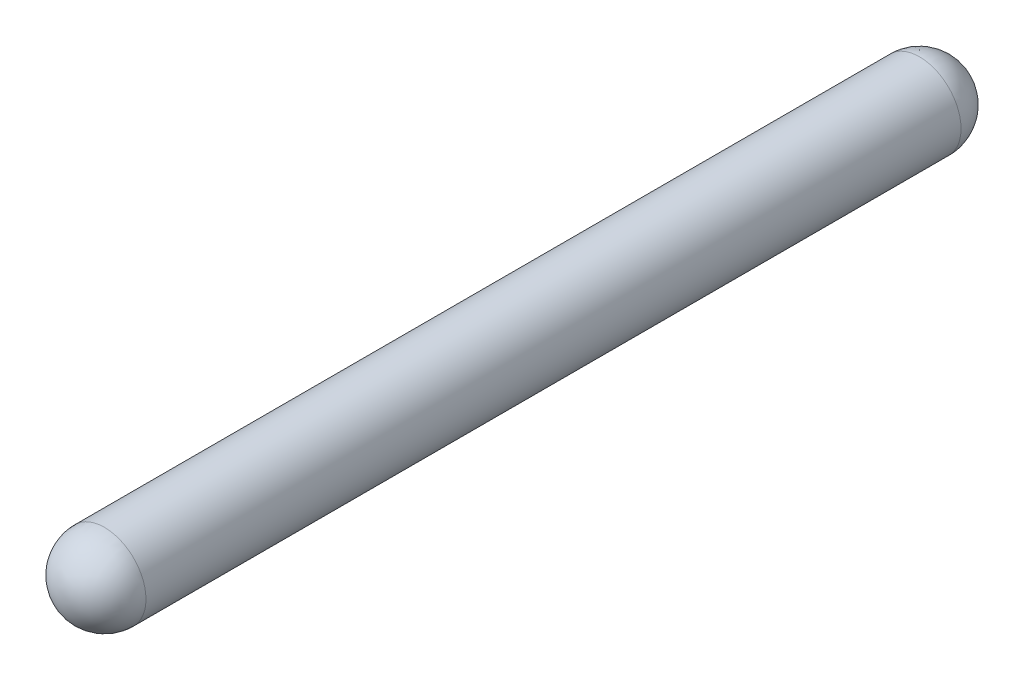
ISO-10303-21;
HEADER;
FILE_DESCRIPTION(('STEP AP214'),'2;1');
FILE_NAME('part.step','',(''),(''),'','','');
FILE_SCHEMA(('AUTOMOTIVE_DESIGN { 1 0 10303 214 1 1 1 1 }'));
ENDSEC;
DATA;
#1=APPLICATION_CONTEXT('core data for automotive mechanical design processes');
#2=APPLICATION_PROTOCOL_DEFINITION('international standard','automotive_design',2000,#1);
#3=PRODUCT_CONTEXT('',#1,'mechanical');
#4=PRODUCT('Part','Part','',(#3));
#5=PRODUCT_RELATED_PRODUCT_CATEGORY('part','',(#4));
#6=PRODUCT_DEFINITION_FORMATION('','',#4);
#7=PRODUCT_DEFINITION_CONTEXT('part definition',#1,'design');
#8=PRODUCT_DEFINITION('design','',#6,#7);
#9=PRODUCT_DEFINITION_SHAPE('','',#8);
#10=(LENGTH_UNIT() NAMED_UNIT(*) SI_UNIT(.MILLI.,.METRE.));
#11=(NAMED_UNIT(*) PLANE_ANGLE_UNIT() SI_UNIT($,.RADIAN.));
#12=(NAMED_UNIT(*) SI_UNIT($,.STERADIAN.) SOLID_ANGLE_UNIT());
#13=UNCERTAINTY_MEASURE_WITH_UNIT(LENGTH_MEASURE(1.E-05),#10,'distance_accuracy_value','');
#14=(GEOMETRIC_REPRESENTATION_CONTEXT(3) GLOBAL_UNCERTAINTY_ASSIGNED_CONTEXT((#13)) GLOBAL_UNIT_ASSIGNED_CONTEXT((#10,
#11,#12)) REPRESENTATION_CONTEXT('',''));
#15=CARTESIAN_POINT('',(0.,0.,0.));
#16=DIRECTION('',(0.,0.,1.));
#17=DIRECTION('',(1.,0.,0.));
#18=AXIS2_PLACEMENT_3D('',#15,#16,#17);
#19=CARTESIAN_POINT('',(-0.936,-8.69,-3.));
#20=DIRECTION('',(1.,0.,0.));
#21=DIRECTION('',(0.,-1.,0.));
#22=AXIS2_PLACEMENT_3D('',#19,#20,#21);
#23=SPHERICAL_SURFACE('',#22,0.331);
#24=CARTESIAN_POINT('',(-0.936,-8.69,-3.));
#25=DIRECTION('',(0.,0.,1.));
#26=DIRECTION('',(1.,0.,0.));
#27=AXIS2_PLACEMENT_3D('',#24,#25,#26);
#28=CIRCLE('',#27,0.331);
#29=CARTESIAN_POINT('',(-0.605,-8.69,-3.));
#30=VERTEX_POINT('',#29);
#31=CARTESIAN_POINT('',(-1.267,-8.69,-3.));
#32=VERTEX_POINT('',#31);
#33=EDGE_CURVE('E42',#30,#32,#28,.T.);
#34=ORIENTED_EDGE('',*,*,#33,.F.);
#35=CARTESIAN_POINT('',(-0.936,-8.69,-3.));
#36=DIRECTION('',(0.,0.,1.));
#37=DIRECTION('',(1.,0.,0.));
#38=AXIS2_PLACEMENT_3D('',#35,#36,#37);
#39=CIRCLE('',#38,0.331);
#40=EDGE_CURVE('E26',#32,#30,#39,.T.);
#41=ORIENTED_EDGE('',*,*,#40,.F.);
#42=EDGE_LOOP('',(#34,#41));
#43=FACE_BOUND('',#42,.T.);
#44=ADVANCED_FACE('F17',(#43),#23,.T.);
#45=CARTESIAN_POINT('',(-0.936,-8.69,3.5));
#46=DIRECTION('',(1.,0.,0.));
#47=DIRECTION('',(0.,1.,0.));
#48=AXIS2_PLACEMENT_3D('',#45,#46,#47);
#49=SPHERICAL_SURFACE('',#48,0.331);
#50=CARTESIAN_POINT('',(-0.936,-8.69,3.5));
#51=DIRECTION('',(0.,0.,1.));
#52=DIRECTION('',(1.,0.,0.));
#53=AXIS2_PLACEMENT_3D('',#50,#51,#52);
#54=CIRCLE('',#53,0.331);
#55=CARTESIAN_POINT('',(-0.605,-8.69,3.5));
#56=VERTEX_POINT('',#55);
#57=CARTESIAN_POINT('',(-1.267,-8.69,3.5));
#58=VERTEX_POINT('',#57);
#59=EDGE_CURVE('E11',#56,#58,#54,.F.);
#60=ORIENTED_EDGE('',*,*,#59,.F.);
#61=CARTESIAN_POINT('',(-0.936,-8.69,3.5));
#62=DIRECTION('',(0.,0.,1.));
#63=DIRECTION('',(1.,0.,0.));
#64=AXIS2_PLACEMENT_3D('',#61,#62,#63);
#65=CIRCLE('',#64,0.331);
#66=EDGE_CURVE('E34',#58,#56,#65,.F.);
#67=ORIENTED_EDGE('',*,*,#66,.F.);
#68=EDGE_LOOP('',(#60,#67));
#69=FACE_BOUND('',#68,.T.);
#70=ADVANCED_FACE('F49',(#69),#49,.T.);
#71=CARTESIAN_POINT('',(-0.936,-8.69,-3.));
#72=DIRECTION('',(0.,0.,1.));
#73=DIRECTION('',(1.,0.,0.));
#74=AXIS2_PLACEMENT_3D('',#71,#72,#73);
#75=CYLINDRICAL_SURFACE('',#74,0.331);
#76=ORIENTED_EDGE('',*,*,#66,.T.);
#77=ORIENTED_EDGE('',*,*,#59,.T.);
#78=EDGE_LOOP('',(#76,#77));
#79=FACE_BOUND('',#78,.T.);
#80=ORIENTED_EDGE('',*,*,#40,.T.);
#81=ORIENTED_EDGE('',*,*,#33,.T.);
#82=EDGE_LOOP('',(#80,#81));
#83=FACE_BOUND('',#82,.T.);
#84=ADVANCED_FACE('F45',(#79,#83),#75,.T.);
#85=CLOSED_SHELL('',(#44,#70,#84));
#86=MANIFOLD_SOLID_BREP('B1',#85);
#87=ADVANCED_BREP_SHAPE_REPRESENTATION('',(#18,#86),#14);
#88=SHAPE_DEFINITION_REPRESENTATION(#9,#87);
ENDSEC;
END-ISO-10303-21;
